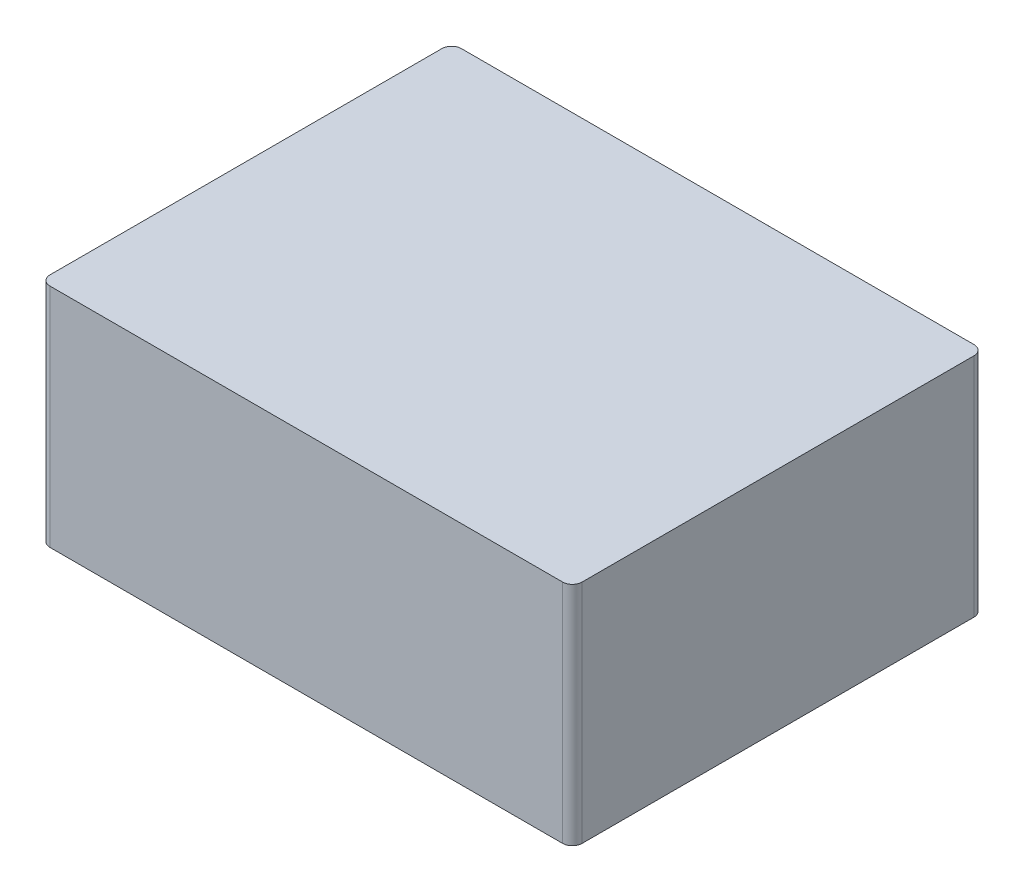
ISO-10303-21;
HEADER;
FILE_DESCRIPTION(('STEP AP214'),'2;1');
FILE_NAME('part.step','',(''),(''),'','','');
FILE_SCHEMA(('AUTOMOTIVE_DESIGN { 1 0 10303 214 1 1 1 1 }'));
ENDSEC;
DATA;
#1=APPLICATION_CONTEXT('core data for automotive mechanical design processes');
#2=APPLICATION_PROTOCOL_DEFINITION('international standard','automotive_design',2000,#1);
#3=PRODUCT_CONTEXT('',#1,'mechanical');
#4=PRODUCT('Part','Part','',(#3));
#5=PRODUCT_RELATED_PRODUCT_CATEGORY('part','',(#4));
#6=PRODUCT_DEFINITION_FORMATION('','',#4);
#7=PRODUCT_DEFINITION_CONTEXT('part definition',#1,'design');
#8=PRODUCT_DEFINITION('design','',#6,#7);
#9=PRODUCT_DEFINITION_SHAPE('','',#8);
#10=(LENGTH_UNIT() NAMED_UNIT(*) SI_UNIT(.MILLI.,.METRE.));
#11=(NAMED_UNIT(*) PLANE_ANGLE_UNIT() SI_UNIT($,.RADIAN.));
#12=(NAMED_UNIT(*) SI_UNIT($,.STERADIAN.) SOLID_ANGLE_UNIT());
#13=UNCERTAINTY_MEASURE_WITH_UNIT(LENGTH_MEASURE(1.E-05),#10,'distance_accuracy_value','');
#14=(GEOMETRIC_REPRESENTATION_CONTEXT(3) GLOBAL_UNCERTAINTY_ASSIGNED_CONTEXT((#13)) GLOBAL_UNIT_ASSIGNED_CONTEXT((#10,
#11,#12)) REPRESENTATION_CONTEXT('',''));
#15=CARTESIAN_POINT('',(0.,0.,0.));
#16=DIRECTION('',(0.,0.,1.));
#17=DIRECTION('',(1.,0.,0.));
#18=AXIS2_PLACEMENT_3D('',#15,#16,#17);
#19=CARTESIAN_POINT('',(0.,46.5,0.));
#20=DIRECTION('',(1.,0.,0.));
#21=DIRECTION('',(0.,0.,-1.));
#22=AXIS2_PLACEMENT_3D('',#19,#20,#21);
#23=PLANE('',#22);
#24=DIRECTION('',(0.,0.,1.));
#25=VECTOR('',#24,1.);
#26=CARTESIAN_POINT('',(0.,46.5,0.));
#27=LINE('',#26,#25);
#28=CARTESIAN_POINT('',(0.,46.5,-82.5));
#29=VERTEX_POINT('',#28);
#30=CARTESIAN_POINT('',(0.,46.5,-2.));
#31=VERTEX_POINT('',#30);
#32=EDGE_CURVE('E124',#29,#31,#27,.T.);
#33=ORIENTED_EDGE('',*,*,#32,.F.);
#34=DIRECTION('',(0.,-1.,0.));
#35=VECTOR('',#34,1.);
#36=CARTESIAN_POINT('',(0.,46.5,-82.5));
#37=LINE('',#36,#35);
#38=CARTESIAN_POINT('',(0.,0.,-82.5));
#39=VERTEX_POINT('',#38);
#40=EDGE_CURVE('E152',#29,#39,#37,.T.);
#41=ORIENTED_EDGE('',*,*,#40,.T.);
#42=DIRECTION('',(0.,0.,1.));
#43=VECTOR('',#42,1.);
#44=CARTESIAN_POINT('',(0.,0.,0.));
#45=LINE('',#44,#43);
#46=CARTESIAN_POINT('',(0.,0.,-2.));
#47=VERTEX_POINT('',#46);
#48=EDGE_CURVE('E126',#39,#47,#45,.T.);
#49=ORIENTED_EDGE('',*,*,#48,.T.);
#50=DIRECTION('',(0.,-1.,0.));
#51=VECTOR('',#50,1.);
#52=CARTESIAN_POINT('',(0.,46.5,-2.));
#53=LINE('',#52,#51);
#54=EDGE_CURVE('E139',#47,#31,#53,.F.);
#55=ORIENTED_EDGE('',*,*,#54,.T.);
#56=EDGE_LOOP('',(#33,#41,#49,#55));
#57=FACE_BOUND('',#56,.T.);
#58=ADVANCED_FACE('F33',(#57),#23,.F.);
#59=CARTESIAN_POINT('',(0.,46.5,0.));
#60=DIRECTION('',(0.,0.,-1.));
#61=DIRECTION('',(-1.,0.,0.));
#62=AXIS2_PLACEMENT_3D('',#59,#60,#61);
#63=PLANE('',#62);
#64=DIRECTION('',(1.,0.,0.));
#65=VECTOR('',#64,1.);
#66=CARTESIAN_POINT('',(0.,46.5,0.));
#67=LINE('',#66,#65);
#68=CARTESIAN_POINT('',(2.,46.5,0.));
#69=VERTEX_POINT('',#68);
#70=CARTESIAN_POINT('',(107.3,46.5,0.));
#71=VERTEX_POINT('',#70);
#72=EDGE_CURVE('E164',#69,#71,#67,.T.);
#73=ORIENTED_EDGE('',*,*,#72,.F.);
#74=DIRECTION('',(0.,-1.,0.));
#75=VECTOR('',#74,1.);
#76=CARTESIAN_POINT('',(2.,46.5,0.));
#77=LINE('',#76,#75);
#78=CARTESIAN_POINT('',(2.,0.,0.));
#79=VERTEX_POINT('',#78);
#80=EDGE_CURVE('E133',#69,#79,#77,.T.);
#81=ORIENTED_EDGE('',*,*,#80,.T.);
#82=DIRECTION('',(1.,0.,0.));
#83=VECTOR('',#82,1.);
#84=CARTESIAN_POINT('',(0.,0.,0.));
#85=LINE('',#84,#83);
#86=CARTESIAN_POINT('',(107.3,0.,0.));
#87=VERTEX_POINT('',#86);
#88=EDGE_CURVE('E122',#79,#87,#85,.T.);
#89=ORIENTED_EDGE('',*,*,#88,.T.);
#90=DIRECTION('',(0.,-1.,0.));
#91=VECTOR('',#90,1.);
#92=CARTESIAN_POINT('',(107.3,46.5,0.));
#93=LINE('',#92,#91);
#94=EDGE_CURVE('E105',#87,#71,#93,.F.);
#95=ORIENTED_EDGE('',*,*,#94,.T.);
#96=EDGE_LOOP('',(#73,#81,#89,#95));
#97=FACE_BOUND('',#96,.T.);
#98=ADVANCED_FACE('F174',(#97),#63,.F.);
#99=CARTESIAN_POINT('',(109.3,46.5,0.));
#100=DIRECTION('',(-1.,0.,0.));
#101=DIRECTION('',(0.,0.,1.));
#102=AXIS2_PLACEMENT_3D('',#99,#100,#101);
#103=PLANE('',#102);
#104=DIRECTION('',(0.,0.,-1.));
#105=VECTOR('',#104,1.);
#106=CARTESIAN_POINT('',(109.3,0.,0.));
#107=LINE('',#106,#105);
#108=CARTESIAN_POINT('',(109.3,0.,-2.));
#109=VERTEX_POINT('',#108);
#110=CARTESIAN_POINT('',(109.3,0.,-82.5));
#111=VERTEX_POINT('',#110);
#112=EDGE_CURVE('E113',#109,#111,#107,.T.);
#113=ORIENTED_EDGE('',*,*,#112,.T.);
#114=DIRECTION('',(0.,-1.,0.));
#115=VECTOR('',#114,1.);
#116=CARTESIAN_POINT('',(109.3,46.5,-82.5));
#117=LINE('',#116,#115);
#118=CARTESIAN_POINT('',(109.3,46.5,-82.5));
#119=VERTEX_POINT('',#118);
#120=EDGE_CURVE('E148',#111,#119,#117,.F.);
#121=ORIENTED_EDGE('',*,*,#120,.T.);
#122=DIRECTION('',(0.,0.,-1.));
#123=VECTOR('',#122,1.);
#124=CARTESIAN_POINT('',(109.3,46.5,0.));
#125=LINE('',#124,#123);
#126=CARTESIAN_POINT('',(109.3,46.5,-2.));
#127=VERTEX_POINT('',#126);
#128=EDGE_CURVE('E116',#127,#119,#125,.T.);
#129=ORIENTED_EDGE('',*,*,#128,.F.);
#130=DIRECTION('',(0.,-1.,0.));
#131=VECTOR('',#130,1.);
#132=CARTESIAN_POINT('',(109.3,46.5,-2.));
#133=LINE('',#132,#131);
#134=EDGE_CURVE('E103',#127,#109,#133,.T.);
#135=ORIENTED_EDGE('',*,*,#134,.T.);
#136=EDGE_LOOP('',(#113,#121,#129,#135));
#137=FACE_BOUND('',#136,.T.);
#138=ADVANCED_FACE('F112',(#137),#103,.F.);
#139=CARTESIAN_POINT('',(0.,46.5,-84.5));
#140=DIRECTION('',(0.,0.,1.));
#141=DIRECTION('',(1.,0.,0.));
#142=AXIS2_PLACEMENT_3D('',#139,#140,#141);
#143=PLANE('',#142);
#144=DIRECTION('',(-1.,0.,0.));
#145=VECTOR('',#144,1.);
#146=CARTESIAN_POINT('',(0.,0.,-84.5));
#147=LINE('',#146,#145);
#148=CARTESIAN_POINT('',(107.3,0.,-84.5));
#149=VERTEX_POINT('',#148);
#150=CARTESIAN_POINT('',(2.,0.,-84.5));
#151=VERTEX_POINT('',#150);
#152=EDGE_CURVE('E121',#149,#151,#147,.T.);
#153=ORIENTED_EDGE('',*,*,#152,.T.);
#154=DIRECTION('',(0.,-1.,0.));
#155=VECTOR('',#154,1.);
#156=CARTESIAN_POINT('',(2.,46.5,-84.5));
#157=LINE('',#156,#155);
#158=CARTESIAN_POINT('',(2.,46.5,-84.5));
#159=VERTEX_POINT('',#158);
#160=EDGE_CURVE('E41',#151,#159,#157,.F.);
#161=ORIENTED_EDGE('',*,*,#160,.T.);
#162=DIRECTION('',(-1.,0.,0.));
#163=VECTOR('',#162,1.);
#164=CARTESIAN_POINT('',(0.,46.5,-84.5));
#165=LINE('',#164,#163);
#166=CARTESIAN_POINT('',(107.3,46.5,-84.5));
#167=VERTEX_POINT('',#166);
#168=EDGE_CURVE('E117',#167,#159,#165,.T.);
#169=ORIENTED_EDGE('',*,*,#168,.F.);
#170=DIRECTION('',(0.,-1.,0.));
#171=VECTOR('',#170,1.);
#172=CARTESIAN_POINT('',(107.3,46.5,-84.5));
#173=LINE('',#172,#171);
#174=EDGE_CURVE('E144',#167,#149,#173,.T.);
#175=ORIENTED_EDGE('',*,*,#174,.T.);
#176=EDGE_LOOP('',(#153,#161,#169,#175));
#177=FACE_BOUND('',#176,.T.);
#178=ADVANCED_FACE('F179',(#177),#143,.F.);
#179=CARTESIAN_POINT('',(0.,46.5,0.));
#180=DIRECTION('',(0.,-1.,0.));
#181=DIRECTION('',(0.,0.,-1.));
#182=AXIS2_PLACEMENT_3D('',#179,#180,#181);
#183=PLANE('',#182);
#184=ORIENTED_EDGE('',*,*,#168,.T.);
#185=CARTESIAN_POINT('',(2.,46.5,-82.5));
#186=DIRECTION('',(0.,-1.,0.));
#187=DIRECTION('',(0.,0.,-1.));
#188=AXIS2_PLACEMENT_3D('',#185,#186,#187);
#189=CIRCLE('',#188,2.);
#190=EDGE_CURVE('E11',#159,#29,#189,.F.);
#191=ORIENTED_EDGE('',*,*,#190,.T.);
#192=ORIENTED_EDGE('',*,*,#32,.T.);
#193=CARTESIAN_POINT('',(2.,46.5,-2.));
#194=DIRECTION('',(0.,-1.,0.));
#195=DIRECTION('',(0.,0.,-1.));
#196=AXIS2_PLACEMENT_3D('',#193,#194,#195);
#197=CIRCLE('',#196,2.);
#198=EDGE_CURVE('E142',#31,#69,#197,.F.);
#199=ORIENTED_EDGE('',*,*,#198,.T.);
#200=ORIENTED_EDGE('',*,*,#72,.T.);
#201=CARTESIAN_POINT('',(107.3,46.5,-2.));
#202=DIRECTION('',(0.,-1.,0.));
#203=DIRECTION('',(0.,0.,-1.));
#204=AXIS2_PLACEMENT_3D('',#201,#202,#203);
#205=CIRCLE('',#204,2.);
#206=EDGE_CURVE('E131',#71,#127,#205,.F.);
#207=ORIENTED_EDGE('',*,*,#206,.T.);
#208=ORIENTED_EDGE('',*,*,#128,.T.);
#209=CARTESIAN_POINT('',(107.3,46.5,-82.5));
#210=DIRECTION('',(0.,-1.,0.));
#211=DIRECTION('',(0.,0.,-1.));
#212=AXIS2_PLACEMENT_3D('',#209,#210,#211);
#213=CIRCLE('',#212,2.);
#214=EDGE_CURVE('E150',#119,#167,#213,.F.);
#215=ORIENTED_EDGE('',*,*,#214,.T.);
#216=EDGE_LOOP('',(#184,#191,#192,#199,#200,#207,#208,#215));
#217=FACE_BOUND('',#216,.T.);
#218=ADVANCED_FACE('F167',(#217),#183,.F.);
#219=CARTESIAN_POINT('',(0.,0.,0.));
#220=DIRECTION('',(0.,-1.,0.));
#221=DIRECTION('',(0.,0.,-1.));
#222=AXIS2_PLACEMENT_3D('',#219,#220,#221);
#223=PLANE('',#222);
#224=ORIENTED_EDGE('',*,*,#48,.F.);
#225=CARTESIAN_POINT('',(2.,0.,-82.5));
#226=DIRECTION('',(0.,-1.,0.));
#227=DIRECTION('',(0.,0.,-1.));
#228=AXIS2_PLACEMENT_3D('',#225,#226,#227);
#229=CIRCLE('',#228,2.);
#230=EDGE_CURVE('E55',#39,#151,#229,.T.);
#231=ORIENTED_EDGE('',*,*,#230,.T.);
#232=ORIENTED_EDGE('',*,*,#152,.F.);
#233=CARTESIAN_POINT('',(107.3,0.,-82.5));
#234=DIRECTION('',(0.,-1.,0.));
#235=DIRECTION('',(0.,0.,-1.));
#236=AXIS2_PLACEMENT_3D('',#233,#234,#235);
#237=CIRCLE('',#236,2.);
#238=EDGE_CURVE('E120',#149,#111,#237,.T.);
#239=ORIENTED_EDGE('',*,*,#238,.T.);
#240=ORIENTED_EDGE('',*,*,#112,.F.);
#241=CARTESIAN_POINT('',(107.3,0.,-2.));
#242=DIRECTION('',(0.,-1.,0.));
#243=DIRECTION('',(0.,0.,-1.));
#244=AXIS2_PLACEMENT_3D('',#241,#242,#243);
#245=CIRCLE('',#244,2.);
#246=EDGE_CURVE('E99',#109,#87,#245,.T.);
#247=ORIENTED_EDGE('',*,*,#246,.T.);
#248=ORIENTED_EDGE('',*,*,#88,.F.);
#249=CARTESIAN_POINT('',(2.,0.,-2.));
#250=DIRECTION('',(0.,-1.,0.));
#251=DIRECTION('',(0.,0.,-1.));
#252=AXIS2_PLACEMENT_3D('',#249,#250,#251);
#253=CIRCLE('',#252,2.);
#254=EDGE_CURVE('E136',#79,#47,#253,.T.);
#255=ORIENTED_EDGE('',*,*,#254,.T.);
#256=EDGE_LOOP('',(#224,#231,#232,#239,#240,#247,#248,#255));
#257=FACE_BOUND('',#256,.T.);
#258=ADVANCED_FACE('F119',(#257),#223,.T.);
#259=CARTESIAN_POINT('',(107.3,46.5,-2.));
#260=DIRECTION('',(0.,-1.,0.));
#261=DIRECTION('',(0.,0.,-1.));
#262=AXIS2_PLACEMENT_3D('',#259,#260,#261);
#263=CYLINDRICAL_SURFACE('',#262,2.);
#264=ORIENTED_EDGE('',*,*,#206,.F.);
#265=ORIENTED_EDGE('',*,*,#94,.F.);
#266=ORIENTED_EDGE('',*,*,#246,.F.);
#267=ORIENTED_EDGE('',*,*,#134,.F.);
#268=EDGE_LOOP('',(#264,#265,#266,#267));
#269=FACE_BOUND('',#268,.T.);
#270=ADVANCED_FACE('F102',(#269),#263,.T.);
#271=CARTESIAN_POINT('',(2.,46.5,-2.));
#272=DIRECTION('',(0.,-1.,0.));
#273=DIRECTION('',(0.,0.,-1.));
#274=AXIS2_PLACEMENT_3D('',#271,#272,#273);
#275=CYLINDRICAL_SURFACE('',#274,2.);
#276=ORIENTED_EDGE('',*,*,#198,.F.);
#277=ORIENTED_EDGE('',*,*,#54,.F.);
#278=ORIENTED_EDGE('',*,*,#254,.F.);
#279=ORIENTED_EDGE('',*,*,#80,.F.);
#280=EDGE_LOOP('',(#276,#277,#278,#279));
#281=FACE_BOUND('',#280,.T.);
#282=ADVANCED_FACE('F172',(#281),#275,.T.);
#283=CARTESIAN_POINT('',(107.3,46.5,-82.5));
#284=DIRECTION('',(0.,-1.,0.));
#285=DIRECTION('',(0.,0.,-1.));
#286=AXIS2_PLACEMENT_3D('',#283,#284,#285);
#287=CYLINDRICAL_SURFACE('',#286,2.);
#288=ORIENTED_EDGE('',*,*,#214,.F.);
#289=ORIENTED_EDGE('',*,*,#120,.F.);
#290=ORIENTED_EDGE('',*,*,#238,.F.);
#291=ORIENTED_EDGE('',*,*,#174,.F.);
#292=EDGE_LOOP('',(#288,#289,#290,#291));
#293=FACE_BOUND('',#292,.T.);
#294=ADVANCED_FACE('F178',(#293),#287,.T.);
#295=CARTESIAN_POINT('',(2.,46.5,-82.5));
#296=DIRECTION('',(0.,-1.,0.));
#297=DIRECTION('',(0.,0.,-1.));
#298=AXIS2_PLACEMENT_3D('',#295,#296,#297);
#299=CYLINDRICAL_SURFACE('',#298,2.);
#300=ORIENTED_EDGE('',*,*,#190,.F.);
#301=ORIENTED_EDGE('',*,*,#160,.F.);
#302=ORIENTED_EDGE('',*,*,#230,.F.);
#303=ORIENTED_EDGE('',*,*,#40,.F.);
#304=EDGE_LOOP('',(#300,#301,#302,#303));
#305=FACE_BOUND('',#304,.T.);
#306=ADVANCED_FACE('F35',(#305),#299,.T.);
#307=CLOSED_SHELL('',(#58,#98,#138,#178,#218,#258,#270,#282,#294,#306));
#308=MANIFOLD_SOLID_BREP('B2',#307);
#309=ADVANCED_BREP_SHAPE_REPRESENTATION('',(#18,#308),#14);
#310=SHAPE_DEFINITION_REPRESENTATION(#9,#309);
ENDSEC;
END-ISO-10303-21;
